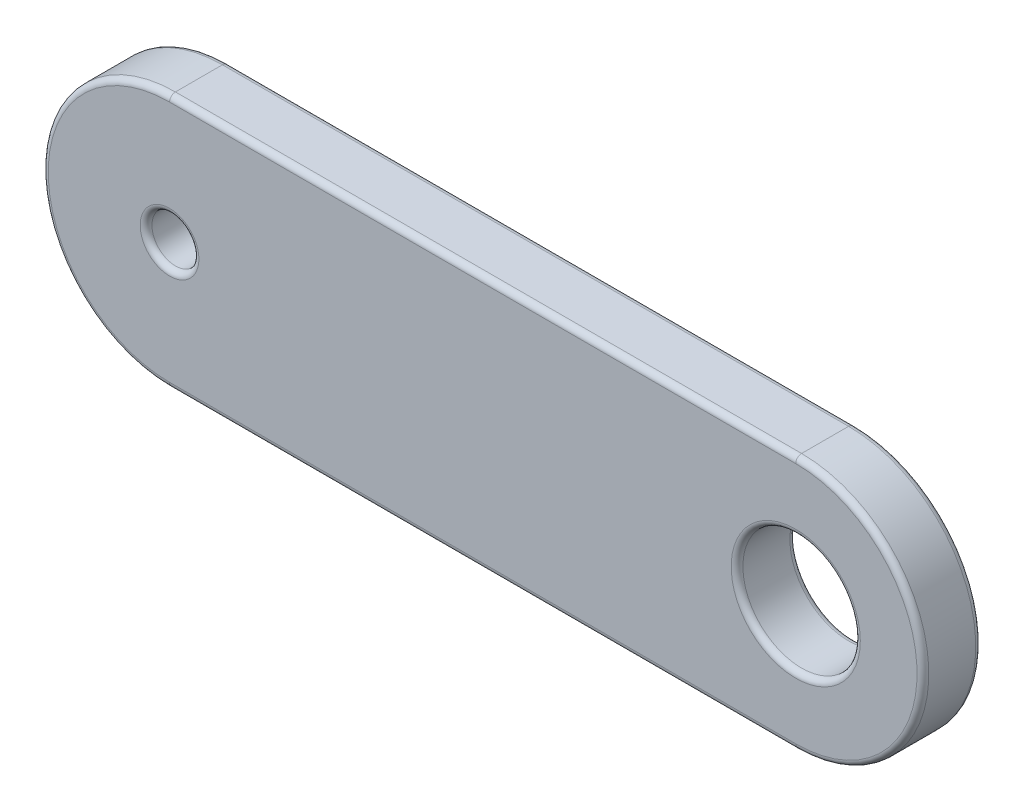
ISO-10303-21;
HEADER;
FILE_DESCRIPTION(('STEP AP214'),'2;1');
FILE_NAME('part.step','',(''),(''),'','','');
FILE_SCHEMA(('AUTOMOTIVE_DESIGN { 1 0 10303 214 1 1 1 1 }'));
ENDSEC;
DATA;
#1=APPLICATION_CONTEXT('core data for automotive mechanical design processes');
#2=APPLICATION_PROTOCOL_DEFINITION('international standard','automotive_design',2000,#1);
#3=PRODUCT_CONTEXT('',#1,'mechanical');
#4=PRODUCT('Part','Part','',(#3));
#5=PRODUCT_RELATED_PRODUCT_CATEGORY('part','',(#4));
#6=PRODUCT_DEFINITION_FORMATION('','',#4);
#7=PRODUCT_DEFINITION_CONTEXT('part definition',#1,'design');
#8=PRODUCT_DEFINITION('design','',#6,#7);
#9=PRODUCT_DEFINITION_SHAPE('','',#8);
#10=(LENGTH_UNIT() NAMED_UNIT(*) SI_UNIT(.MILLI.,.METRE.));
#11=(NAMED_UNIT(*) PLANE_ANGLE_UNIT() SI_UNIT($,.RADIAN.));
#12=(NAMED_UNIT(*) SI_UNIT($,.STERADIAN.) SOLID_ANGLE_UNIT());
#13=UNCERTAINTY_MEASURE_WITH_UNIT(LENGTH_MEASURE(1.E-05),#10,'distance_accuracy_value','');
#14=(GEOMETRIC_REPRESENTATION_CONTEXT(3) GLOBAL_UNCERTAINTY_ASSIGNED_CONTEXT((#13)) GLOBAL_UNIT_ASSIGNED_CONTEXT((#10,
#11,#12)) REPRESENTATION_CONTEXT('',''));
#15=CARTESIAN_POINT('',(0.,0.,0.));
#16=DIRECTION('',(0.,0.,1.));
#17=DIRECTION('',(1.,0.,0.));
#18=AXIS2_PLACEMENT_3D('',#15,#16,#17);
#19=CARTESIAN_POINT('',(-8.,0.,0.75));
#20=DIRECTION('',(0.,0.,1.));
#21=DIRECTION('',(1.,0.,0.));
#22=AXIS2_PLACEMENT_3D('',#19,#20,#21);
#23=PLANE('',#22);
#24=CARTESIAN_POINT('',(8.,0.,0.75));
#25=DIRECTION('',(0.,0.,1.));
#26=DIRECTION('',(1.,0.,0.));
#27=AXIS2_PLACEMENT_3D('',#24,#25,#26);
#28=CIRCLE('',#27,1.65);
#29=CARTESIAN_POINT('',(9.65,0.,0.75));
#30=VERTEX_POINT('',#29);
#31=EDGE_CURVE('E11',#30,#30,#28,.F.);
#32=ORIENTED_EDGE('',*,*,#31,.T.);
#33=EDGE_LOOP('',(#32));
#34=FACE_BOUND('',#33,.T.);
#35=CARTESIAN_POINT('',(8.,0.,0.75));
#36=DIRECTION('',(0.,0.,1.));
#37=DIRECTION('',(1.,0.,0.));
#38=AXIS2_PLACEMENT_3D('',#35,#36,#37);
#39=CIRCLE('',#38,3.1);
#40=CARTESIAN_POINT('',(8.,-3.1,0.75));
#41=VERTEX_POINT('',#40);
#42=CARTESIAN_POINT('',(8.,3.1,0.75));
#43=VERTEX_POINT('',#42);
#44=EDGE_CURVE('E50',#41,#43,#39,.T.);
#45=ORIENTED_EDGE('',*,*,#44,.T.);
#46=DIRECTION('',(-1.,0.,0.));
#47=VECTOR('',#46,1.);
#48=CARTESIAN_POINT('',(-8.,3.1,0.75));
#49=LINE('',#48,#47);
#50=CARTESIAN_POINT('',(-8.,3.1,0.75));
#51=VERTEX_POINT('',#50);
#52=EDGE_CURVE('E42',#43,#51,#49,.T.);
#53=ORIENTED_EDGE('',*,*,#52,.T.);
#54=CARTESIAN_POINT('',(-8.,0.,0.75));
#55=DIRECTION('',(0.,0.,1.));
#56=DIRECTION('',(1.,0.,0.));
#57=AXIS2_PLACEMENT_3D('',#54,#55,#56);
#58=CIRCLE('',#57,3.1);
#59=CARTESIAN_POINT('',(-8.,-3.1,0.75));
#60=VERTEX_POINT('',#59);
#61=EDGE_CURVE('E168',#51,#60,#58,.T.);
#62=ORIENTED_EDGE('',*,*,#61,.T.);
#63=DIRECTION('',(1.,0.,0.));
#64=VECTOR('',#63,1.);
#65=CARTESIAN_POINT('',(8.,-3.1,0.75));
#66=LINE('',#65,#64);
#67=EDGE_CURVE('E55',#60,#41,#66,.T.);
#68=ORIENTED_EDGE('',*,*,#67,.T.);
#69=EDGE_LOOP('',(#45,#53,#62,#68));
#70=FACE_BOUND('',#69,.T.);
#71=CARTESIAN_POINT('',(-8.,0.,0.75));
#72=DIRECTION('',(0.,0.,1.));
#73=DIRECTION('',(1.,0.,0.));
#74=AXIS2_PLACEMENT_3D('',#71,#72,#73);
#75=CIRCLE('',#74,0.75);
#76=CARTESIAN_POINT('',(-7.25,0.,0.75));
#77=VERTEX_POINT('',#76);
#78=EDGE_CURVE('E165',#77,#77,#75,.F.);
#79=ORIENTED_EDGE('',*,*,#78,.T.);
#80=EDGE_LOOP('',(#79));
#81=FACE_BOUND('',#80,.T.);
#82=ADVANCED_FACE('F33',(#34,#70,#81),#23,.T.);
#83=CARTESIAN_POINT('',(-8.,0.,-0.75));
#84=DIRECTION('',(0.,0.,1.));
#85=DIRECTION('',(1.,0.,0.));
#86=AXIS2_PLACEMENT_3D('',#83,#84,#85);
#87=PLANE('',#86);
#88=CARTESIAN_POINT('',(8.,0.,-0.75));
#89=DIRECTION('',(0.,0.,1.));
#90=DIRECTION('',(1.,0.,0.));
#91=AXIS2_PLACEMENT_3D('',#88,#89,#90);
#92=CIRCLE('',#91,1.65);
#93=CARTESIAN_POINT('',(9.65,0.,-0.75));
#94=VERTEX_POINT('',#93);
#95=EDGE_CURVE('E130',#94,#94,#92,.T.);
#96=ORIENTED_EDGE('',*,*,#95,.T.);
#97=EDGE_LOOP('',(#96));
#98=FACE_BOUND('',#97,.T.);
#99=CARTESIAN_POINT('',(-8.,0.,-0.75));
#100=DIRECTION('',(0.,0.,1.));
#101=DIRECTION('',(1.,0.,0.));
#102=AXIS2_PLACEMENT_3D('',#99,#100,#101);
#103=CIRCLE('',#102,0.75);
#104=CARTESIAN_POINT('',(-7.25,0.,-0.75));
#105=VERTEX_POINT('',#104);
#106=EDGE_CURVE('E127',#105,#105,#103,.T.);
#107=ORIENTED_EDGE('',*,*,#106,.T.);
#108=EDGE_LOOP('',(#107));
#109=FACE_BOUND('',#108,.T.);
#110=CARTESIAN_POINT('',(8.,0.,-0.75));
#111=DIRECTION('',(0.,0.,1.));
#112=DIRECTION('',(1.,0.,0.));
#113=AXIS2_PLACEMENT_3D('',#110,#111,#112);
#114=CIRCLE('',#113,3.1);
#115=CARTESIAN_POINT('',(8.,3.1,-0.75));
#116=VERTEX_POINT('',#115);
#117=CARTESIAN_POINT('',(8.,-3.1,-0.75));
#118=VERTEX_POINT('',#117);
#119=EDGE_CURVE('E126',#116,#118,#114,.F.);
#120=ORIENTED_EDGE('',*,*,#119,.T.);
#121=DIRECTION('',(1.,0.,0.));
#122=VECTOR('',#121,1.);
#123=CARTESIAN_POINT('',(-8.,-3.1,-0.75));
#124=LINE('',#123,#122);
#125=CARTESIAN_POINT('',(-8.,-3.1,-0.75));
#126=VERTEX_POINT('',#125);
#127=EDGE_CURVE('E105',#118,#126,#124,.F.);
#128=ORIENTED_EDGE('',*,*,#127,.T.);
#129=CARTESIAN_POINT('',(-8.,0.,-0.75));
#130=DIRECTION('',(0.,0.,1.));
#131=DIRECTION('',(1.,0.,0.));
#132=AXIS2_PLACEMENT_3D('',#129,#130,#131);
#133=CIRCLE('',#132,3.1);
#134=CARTESIAN_POINT('',(-8.,3.1,-0.75));
#135=VERTEX_POINT('',#134);
#136=EDGE_CURVE('E115',#126,#135,#133,.F.);
#137=ORIENTED_EDGE('',*,*,#136,.T.);
#138=DIRECTION('',(-1.,0.,0.));
#139=VECTOR('',#138,1.);
#140=CARTESIAN_POINT('',(-8.,3.1,-0.75));
#141=LINE('',#140,#139);
#142=EDGE_CURVE('E121',#135,#116,#141,.F.);
#143=ORIENTED_EDGE('',*,*,#142,.T.);
#144=EDGE_LOOP('',(#120,#128,#137,#143));
#145=FACE_BOUND('',#144,.T.);
#146=ADVANCED_FACE('F124',(#98,#109,#145),#87,.F.);
#147=CARTESIAN_POINT('',(-8.,0.,0.75));
#148=DIRECTION('',(0.,0.,-1.));
#149=DIRECTION('',(-1.,0.,0.));
#150=AXIS2_PLACEMENT_3D('',#147,#148,#149);
#151=CYLINDRICAL_SURFACE('',#150,3.25);
#152=DIRECTION('',(0.,0.,-1.));
#153=VECTOR('',#152,1.);
#154=CARTESIAN_POINT('',(-8.,3.25,0.75));
#155=LINE('',#154,#153);
#156=CARTESIAN_POINT('',(-8.,3.25,0.6));
#157=VERTEX_POINT('',#156);
#158=CARTESIAN_POINT('',(-8.,3.25,-0.6));
#159=VERTEX_POINT('',#158);
#160=EDGE_CURVE('E177',#157,#159,#155,.T.);
#161=ORIENTED_EDGE('',*,*,#160,.T.);
#162=CARTESIAN_POINT('',(-8.,0.,-0.6));
#163=DIRECTION('',(0.,0.,1.));
#164=DIRECTION('',(1.,0.,0.));
#165=AXIS2_PLACEMENT_3D('',#162,#163,#164);
#166=CIRCLE('',#165,3.25);
#167=CARTESIAN_POINT('',(-8.,-3.25,-0.6));
#168=VERTEX_POINT('',#167);
#169=EDGE_CURVE('E163',#159,#168,#166,.T.);
#170=ORIENTED_EDGE('',*,*,#169,.T.);
#171=DIRECTION('',(0.,0.,-1.));
#172=VECTOR('',#171,1.);
#173=CARTESIAN_POINT('',(-8.,-3.25,0.75));
#174=LINE('',#173,#172);
#175=CARTESIAN_POINT('',(-8.,-3.25,0.6));
#176=VERTEX_POINT('',#175);
#177=EDGE_CURVE('E122',#176,#168,#174,.T.);
#178=ORIENTED_EDGE('',*,*,#177,.F.);
#179=CARTESIAN_POINT('',(-8.,0.,0.6));
#180=DIRECTION('',(0.,0.,1.));
#181=DIRECTION('',(1.,0.,0.));
#182=AXIS2_PLACEMENT_3D('',#179,#180,#181);
#183=CIRCLE('',#182,3.25);
#184=EDGE_CURVE('E161',#176,#157,#183,.F.);
#185=ORIENTED_EDGE('',*,*,#184,.T.);
#186=EDGE_LOOP('',(#161,#170,#178,#185));
#187=FACE_BOUND('',#186,.T.);
#188=ADVANCED_FACE('F203',(#187),#151,.T.);
#189=CARTESIAN_POINT('',(-8.,-3.25,0.75));
#190=DIRECTION('',(0.,1.,0.));
#191=DIRECTION('',(0.,0.,1.));
#192=AXIS2_PLACEMENT_3D('',#189,#190,#191);
#193=PLANE('',#192);
#194=ORIENTED_EDGE('',*,*,#177,.T.);
#195=DIRECTION('',(1.,0.,0.));
#196=VECTOR('',#195,1.);
#197=CARTESIAN_POINT('',(-8.,-3.25,-0.6));
#198=LINE('',#197,#196);
#199=CARTESIAN_POINT('',(8.,-3.25,-0.6));
#200=VERTEX_POINT('',#199);
#201=EDGE_CURVE('E108',#168,#200,#198,.T.);
#202=ORIENTED_EDGE('',*,*,#201,.T.);
#203=DIRECTION('',(0.,0.,-1.));
#204=VECTOR('',#203,1.);
#205=CARTESIAN_POINT('',(8.,-3.25,0.75));
#206=LINE('',#205,#204);
#207=CARTESIAN_POINT('',(8.,-3.25,0.6));
#208=VERTEX_POINT('',#207);
#209=EDGE_CURVE('E200',#208,#200,#206,.T.);
#210=ORIENTED_EDGE('',*,*,#209,.F.);
#211=DIRECTION('',(1.,0.,0.));
#212=VECTOR('',#211,1.);
#213=CARTESIAN_POINT('',(-8.,-3.25,0.6));
#214=LINE('',#213,#212);
#215=EDGE_CURVE('E149',#208,#176,#214,.F.);
#216=ORIENTED_EDGE('',*,*,#215,.T.);
#217=EDGE_LOOP('',(#194,#202,#210,#216));
#218=FACE_BOUND('',#217,.T.);
#219=ADVANCED_FACE('F198',(#218),#193,.F.);
#220=CARTESIAN_POINT('',(8.,0.,0.75));
#221=DIRECTION('',(0.,0.,-1.));
#222=DIRECTION('',(-1.,0.,0.));
#223=AXIS2_PLACEMENT_3D('',#220,#221,#222);
#224=CYLINDRICAL_SURFACE('',#223,3.25);
#225=ORIENTED_EDGE('',*,*,#209,.T.);
#226=CARTESIAN_POINT('',(8.,0.,-0.6));
#227=DIRECTION('',(0.,0.,1.));
#228=DIRECTION('',(1.,0.,0.));
#229=AXIS2_PLACEMENT_3D('',#226,#227,#228);
#230=CIRCLE('',#229,3.25);
#231=CARTESIAN_POINT('',(8.,3.25,-0.6));
#232=VERTEX_POINT('',#231);
#233=EDGE_CURVE('E154',#200,#232,#230,.T.);
#234=ORIENTED_EDGE('',*,*,#233,.T.);
#235=DIRECTION('',(0.,0.,-1.));
#236=VECTOR('',#235,1.);
#237=CARTESIAN_POINT('',(8.,3.25,0.75));
#238=LINE('',#237,#236);
#239=CARTESIAN_POINT('',(8.,3.25,0.6));
#240=VERTEX_POINT('',#239);
#241=EDGE_CURVE('E206',#240,#232,#238,.T.);
#242=ORIENTED_EDGE('',*,*,#241,.F.);
#243=CARTESIAN_POINT('',(8.,0.,0.6));
#244=DIRECTION('',(0.,0.,1.));
#245=DIRECTION('',(1.,0.,0.));
#246=AXIS2_PLACEMENT_3D('',#243,#244,#245);
#247=CIRCLE('',#246,3.25);
#248=EDGE_CURVE('E152',#240,#208,#247,.F.);
#249=ORIENTED_EDGE('',*,*,#248,.T.);
#250=EDGE_LOOP('',(#225,#234,#242,#249));
#251=FACE_BOUND('',#250,.T.);
#252=ADVANCED_FACE('F219',(#251),#224,.T.);
#253=CARTESIAN_POINT('',(-8.,3.25,0.75));
#254=DIRECTION('',(0.,-1.,0.));
#255=DIRECTION('',(1.,0.,0.));
#256=AXIS2_PLACEMENT_3D('',#253,#254,#255);
#257=PLANE('',#256);
#258=ORIENTED_EDGE('',*,*,#241,.T.);
#259=DIRECTION('',(-1.,0.,0.));
#260=VECTOR('',#259,1.);
#261=CARTESIAN_POINT('',(-8.,3.25,-0.6));
#262=LINE('',#261,#260);
#263=EDGE_CURVE('E159',#232,#159,#262,.T.);
#264=ORIENTED_EDGE('',*,*,#263,.T.);
#265=ORIENTED_EDGE('',*,*,#160,.F.);
#266=DIRECTION('',(-1.,0.,0.));
#267=VECTOR('',#266,1.);
#268=CARTESIAN_POINT('',(8.,3.25,0.6));
#269=LINE('',#268,#267);
#270=EDGE_CURVE('E156',#157,#240,#269,.F.);
#271=ORIENTED_EDGE('',*,*,#270,.T.);
#272=EDGE_LOOP('',(#258,#264,#265,#271));
#273=FACE_BOUND('',#272,.T.);
#274=ADVANCED_FACE('F223',(#273),#257,.F.);
#275=CARTESIAN_POINT('',(-8.,0.,0.75));
#276=DIRECTION('',(0.,0.,-1.));
#277=DIRECTION('',(-1.,0.,0.));
#278=AXIS2_PLACEMENT_3D('',#275,#276,#277);
#279=CYLINDRICAL_SURFACE('',#278,0.6);
#280=CARTESIAN_POINT('',(-8.,0.,-0.6));
#281=DIRECTION('',(0.,0.,1.));
#282=DIRECTION('',(1.,0.,0.));
#283=AXIS2_PLACEMENT_3D('',#280,#281,#282);
#284=CIRCLE('',#283,0.6);
#285=CARTESIAN_POINT('',(-7.4,0.,-0.6));
#286=VERTEX_POINT('',#285);
#287=EDGE_CURVE('E146',#286,#286,#284,.F.);
#288=ORIENTED_EDGE('',*,*,#287,.T.);
#289=EDGE_LOOP('',(#288));
#290=FACE_BOUND('',#289,.T.);
#291=CARTESIAN_POINT('',(-8.,0.,0.6));
#292=DIRECTION('',(0.,0.,1.));
#293=DIRECTION('',(1.,0.,0.));
#294=AXIS2_PLACEMENT_3D('',#291,#292,#293);
#295=CIRCLE('',#294,0.6);
#296=CARTESIAN_POINT('',(-7.4,0.,0.6));
#297=VERTEX_POINT('',#296);
#298=EDGE_CURVE('E143',#297,#297,#295,.T.);
#299=ORIENTED_EDGE('',*,*,#298,.T.);
#300=EDGE_LOOP('',(#299));
#301=FACE_BOUND('',#300,.T.);
#302=ADVANCED_FACE('F239',(#290,#301),#279,.F.);
#303=CARTESIAN_POINT('',(8.,0.,0.75));
#304=DIRECTION('',(0.,0.,-1.));
#305=DIRECTION('',(-1.,0.,0.));
#306=AXIS2_PLACEMENT_3D('',#303,#304,#305);
#307=CYLINDRICAL_SURFACE('',#306,1.5);
#308=CARTESIAN_POINT('',(8.,0.,-0.6));
#309=DIRECTION('',(0.,0.,1.));
#310=DIRECTION('',(1.,0.,0.));
#311=AXIS2_PLACEMENT_3D('',#308,#309,#310);
#312=CIRCLE('',#311,1.5);
#313=CARTESIAN_POINT('',(9.5,0.,-0.6));
#314=VERTEX_POINT('',#313);
#315=EDGE_CURVE('E140',#314,#314,#312,.F.);
#316=ORIENTED_EDGE('',*,*,#315,.T.);
#317=EDGE_LOOP('',(#316));
#318=FACE_BOUND('',#317,.T.);
#319=CARTESIAN_POINT('',(8.,0.,0.6));
#320=DIRECTION('',(0.,0.,1.));
#321=DIRECTION('',(1.,0.,0.));
#322=AXIS2_PLACEMENT_3D('',#319,#320,#321);
#323=CIRCLE('',#322,1.5);
#324=CARTESIAN_POINT('',(9.5,0.,0.6));
#325=VERTEX_POINT('',#324);
#326=EDGE_CURVE('E137',#325,#325,#323,.T.);
#327=ORIENTED_EDGE('',*,*,#326,.T.);
#328=EDGE_LOOP('',(#327));
#329=FACE_BOUND('',#328,.T.);
#330=ADVANCED_FACE('F241',(#318,#329),#307,.F.);
#331=CARTESIAN_POINT('',(8.,0.,-0.6));
#332=DIRECTION('',(0.,0.,1.));
#333=DIRECTION('',(1.,0.,0.));
#334=AXIS2_PLACEMENT_3D('',#331,#332,#333);
#335=TOROIDAL_SURFACE('',#334,1.65,0.15);
#336=ORIENTED_EDGE('',*,*,#315,.F.);
#337=EDGE_LOOP('',(#336));
#338=FACE_BOUND('',#337,.T.);
#339=ORIENTED_EDGE('',*,*,#95,.F.);
#340=EDGE_LOOP('',(#339));
#341=FACE_BOUND('',#340,.T.);
#342=ADVANCED_FACE('F248',(#338,#341),#335,.T.);
#343=CARTESIAN_POINT('',(-8.,0.,-0.6));
#344=DIRECTION('',(0.,0.,1.));
#345=DIRECTION('',(1.,0.,0.));
#346=AXIS2_PLACEMENT_3D('',#343,#344,#345);
#347=TOROIDAL_SURFACE('',#346,0.75,0.15);
#348=ORIENTED_EDGE('',*,*,#287,.F.);
#349=EDGE_LOOP('',(#348));
#350=FACE_BOUND('',#349,.T.);
#351=ORIENTED_EDGE('',*,*,#106,.F.);
#352=EDGE_LOOP('',(#351));
#353=FACE_BOUND('',#352,.T.);
#354=ADVANCED_FACE('F264',(#350,#353),#347,.T.);
#355=CARTESIAN_POINT('',(-8.,3.1,-0.6));
#356=DIRECTION('',(-1.,0.,0.));
#357=DIRECTION('',(0.,-1.,0.));
#358=AXIS2_PLACEMENT_3D('',#355,#356,#357);
#359=CYLINDRICAL_SURFACE('',#358,0.15);
#360=CARTESIAN_POINT('',(8.,3.1,-0.6));
#361=DIRECTION('',(1.,0.,0.));
#362=DIRECTION('',(0.,0.,-1.));
#363=AXIS2_PLACEMENT_3D('',#360,#361,#362);
#364=CIRCLE('',#363,0.15);
#365=EDGE_CURVE('E111',#116,#232,#364,.T.);
#366=ORIENTED_EDGE('',*,*,#365,.F.);
#367=ORIENTED_EDGE('',*,*,#142,.F.);
#368=CARTESIAN_POINT('',(-8.,3.1,-0.6));
#369=DIRECTION('',(-1.,0.,0.));
#370=DIRECTION('',(0.,0.,1.));
#371=AXIS2_PLACEMENT_3D('',#368,#369,#370);
#372=CIRCLE('',#371,0.15);
#373=EDGE_CURVE('E118',#159,#135,#372,.T.);
#374=ORIENTED_EDGE('',*,*,#373,.F.);
#375=ORIENTED_EDGE('',*,*,#263,.F.);
#376=EDGE_LOOP('',(#366,#367,#374,#375));
#377=FACE_BOUND('',#376,.T.);
#378=ADVANCED_FACE('F212',(#377),#359,.T.);
#379=CARTESIAN_POINT('',(-8.,0.,-0.6));
#380=DIRECTION('',(0.,0.,1.));
#381=DIRECTION('',(1.,0.,0.));
#382=AXIS2_PLACEMENT_3D('',#379,#380,#381);
#383=TOROIDAL_SURFACE('',#382,3.1,0.15);
#384=ORIENTED_EDGE('',*,*,#373,.T.);
#385=ORIENTED_EDGE('',*,*,#136,.F.);
#386=CARTESIAN_POINT('',(-8.,-3.1,-0.6));
#387=DIRECTION('',(1.,0.,0.));
#388=DIRECTION('',(0.,0.,-1.));
#389=AXIS2_PLACEMENT_3D('',#386,#387,#388);
#390=CIRCLE('',#389,0.15);
#391=EDGE_CURVE('E101',#168,#126,#390,.T.);
#392=ORIENTED_EDGE('',*,*,#391,.F.);
#393=ORIENTED_EDGE('',*,*,#169,.F.);
#394=EDGE_LOOP('',(#384,#385,#392,#393));
#395=FACE_BOUND('',#394,.T.);
#396=ADVANCED_FACE('F116',(#395),#383,.T.);
#397=CARTESIAN_POINT('',(8.,0.,-0.6));
#398=DIRECTION('',(0.,0.,1.));
#399=DIRECTION('',(1.,0.,0.));
#400=AXIS2_PLACEMENT_3D('',#397,#398,#399);
#401=TOROIDAL_SURFACE('',#400,3.1,0.15);
#402=ORIENTED_EDGE('',*,*,#365,.T.);
#403=ORIENTED_EDGE('',*,*,#233,.F.);
#404=CARTESIAN_POINT('',(8.,-3.1,-0.6));
#405=DIRECTION('',(-1.,0.,0.));
#406=DIRECTION('',(0.,0.,1.));
#407=AXIS2_PLACEMENT_3D('',#404,#405,#406);
#408=CIRCLE('',#407,0.15);
#409=EDGE_CURVE('E112',#118,#200,#408,.T.);
#410=ORIENTED_EDGE('',*,*,#409,.F.);
#411=ORIENTED_EDGE('',*,*,#119,.F.);
#412=EDGE_LOOP('',(#402,#403,#410,#411));
#413=FACE_BOUND('',#412,.T.);
#414=ADVANCED_FACE('F215',(#413),#401,.T.);
#415=CARTESIAN_POINT('',(-8.,-3.1,-0.6));
#416=DIRECTION('',(1.,0.,0.));
#417=DIRECTION('',(0.,0.,-1.));
#418=AXIS2_PLACEMENT_3D('',#415,#416,#417);
#419=CYLINDRICAL_SURFACE('',#418,0.15);
#420=ORIENTED_EDGE('',*,*,#391,.T.);
#421=ORIENTED_EDGE('',*,*,#127,.F.);
#422=ORIENTED_EDGE('',*,*,#409,.T.);
#423=ORIENTED_EDGE('',*,*,#201,.F.);
#424=EDGE_LOOP('',(#420,#421,#422,#423));
#425=FACE_BOUND('',#424,.T.);
#426=ADVANCED_FACE('F103',(#425),#419,.T.);
#427=CARTESIAN_POINT('',(8.,0.,0.6));
#428=DIRECTION('',(0.,0.,1.));
#429=DIRECTION('',(1.,0.,0.));
#430=AXIS2_PLACEMENT_3D('',#427,#428,#429);
#431=TOROIDAL_SURFACE('',#430,1.65,0.15);
#432=ORIENTED_EDGE('',*,*,#31,.F.);
#433=EDGE_LOOP('',(#432));
#434=FACE_BOUND('',#433,.T.);
#435=ORIENTED_EDGE('',*,*,#326,.F.);
#436=EDGE_LOOP('',(#435));
#437=FACE_BOUND('',#436,.T.);
#438=ADVANCED_FACE('F271',(#434,#437),#431,.T.);
#439=CARTESIAN_POINT('',(-8.,-3.1,0.6));
#440=DIRECTION('',(-1.,0.,0.));
#441=DIRECTION('',(0.,0.,1.));
#442=AXIS2_PLACEMENT_3D('',#439,#440,#441);
#443=CYLINDRICAL_SURFACE('',#442,0.15);
#444=CARTESIAN_POINT('',(-8.,-3.1,0.6));
#445=DIRECTION('',(-1.,0.,0.));
#446=DIRECTION('',(0.,0.,1.));
#447=AXIS2_PLACEMENT_3D('',#444,#445,#446);
#448=CIRCLE('',#447,0.15);
#449=EDGE_CURVE('E181',#176,#60,#448,.T.);
#450=ORIENTED_EDGE('',*,*,#449,.F.);
#451=ORIENTED_EDGE('',*,*,#215,.F.);
#452=CARTESIAN_POINT('',(8.,-3.1,0.6));
#453=DIRECTION('',(1.,0.,0.));
#454=DIRECTION('',(0.,0.,-1.));
#455=AXIS2_PLACEMENT_3D('',#452,#453,#454);
#456=CIRCLE('',#455,0.15);
#457=EDGE_CURVE('E37',#41,#208,#456,.T.);
#458=ORIENTED_EDGE('',*,*,#457,.F.);
#459=ORIENTED_EDGE('',*,*,#67,.F.);
#460=EDGE_LOOP('',(#450,#451,#458,#459));
#461=FACE_BOUND('',#460,.T.);
#462=ADVANCED_FACE('F193',(#461),#443,.T.);
#463=CARTESIAN_POINT('',(8.,0.,0.6));
#464=DIRECTION('',(0.,0.,1.));
#465=DIRECTION('',(1.,0.,0.));
#466=AXIS2_PLACEMENT_3D('',#463,#464,#465);
#467=TOROIDAL_SURFACE('',#466,3.1,0.15);
#468=ORIENTED_EDGE('',*,*,#457,.T.);
#469=ORIENTED_EDGE('',*,*,#248,.F.);
#470=CARTESIAN_POINT('',(8.,3.1,0.6));
#471=DIRECTION('',(-1.,0.,0.));
#472=DIRECTION('',(0.,0.,1.));
#473=AXIS2_PLACEMENT_3D('',#470,#471,#472);
#474=CIRCLE('',#473,0.15);
#475=EDGE_CURVE('E180',#43,#240,#474,.T.);
#476=ORIENTED_EDGE('',*,*,#475,.F.);
#477=ORIENTED_EDGE('',*,*,#44,.F.);
#478=EDGE_LOOP('',(#468,#469,#476,#477));
#479=FACE_BOUND('',#478,.T.);
#480=ADVANCED_FACE('F190',(#479),#467,.T.);
#481=CARTESIAN_POINT('',(-8.,0.,0.6));
#482=DIRECTION('',(0.,0.,1.));
#483=DIRECTION('',(1.,0.,0.));
#484=AXIS2_PLACEMENT_3D('',#481,#482,#483);
#485=TOROIDAL_SURFACE('',#484,3.1,0.15);
#486=ORIENTED_EDGE('',*,*,#449,.T.);
#487=ORIENTED_EDGE('',*,*,#61,.F.);
#488=CARTESIAN_POINT('',(-8.,3.1,0.6));
#489=DIRECTION('',(1.,0.,0.));
#490=DIRECTION('',(0.,0.,-1.));
#491=AXIS2_PLACEMENT_3D('',#488,#489,#490);
#492=CIRCLE('',#491,0.15);
#493=EDGE_CURVE('E178',#157,#51,#492,.T.);
#494=ORIENTED_EDGE('',*,*,#493,.F.);
#495=ORIENTED_EDGE('',*,*,#184,.F.);
#496=EDGE_LOOP('',(#486,#487,#494,#495));
#497=FACE_BOUND('',#496,.T.);
#498=ADVANCED_FACE('F228',(#497),#485,.T.);
#499=CARTESIAN_POINT('',(-8.,3.1,0.6));
#500=DIRECTION('',(1.,0.,0.));
#501=DIRECTION('',(0.,1.,0.));
#502=AXIS2_PLACEMENT_3D('',#499,#500,#501);
#503=CYLINDRICAL_SURFACE('',#502,0.15);
#504=ORIENTED_EDGE('',*,*,#475,.T.);
#505=ORIENTED_EDGE('',*,*,#270,.F.);
#506=ORIENTED_EDGE('',*,*,#493,.T.);
#507=ORIENTED_EDGE('',*,*,#52,.F.);
#508=EDGE_LOOP('',(#504,#505,#506,#507));
#509=FACE_BOUND('',#508,.T.);
#510=ADVANCED_FACE('F226',(#509),#503,.T.);
#511=CARTESIAN_POINT('',(-8.,0.,0.6));
#512=DIRECTION('',(0.,0.,1.));
#513=DIRECTION('',(1.,0.,0.));
#514=AXIS2_PLACEMENT_3D('',#511,#512,#513);
#515=TOROIDAL_SURFACE('',#514,0.75,0.15);
#516=ORIENTED_EDGE('',*,*,#78,.F.);
#517=EDGE_LOOP('',(#516));
#518=FACE_BOUND('',#517,.T.);
#519=ORIENTED_EDGE('',*,*,#298,.F.);
#520=EDGE_LOOP('',(#519));
#521=FACE_BOUND('',#520,.T.);
#522=ADVANCED_FACE('F35',(#518,#521),#515,.T.);
#523=CLOSED_SHELL('',(#82,#146,#188,#219,#252,#274,#302,#330,#342,#354,#378,#396,#414,#426,#438,
#462,#480,#498,#510,#522));
#524=MANIFOLD_SOLID_BREP('B2',#523);
#525=ADVANCED_BREP_SHAPE_REPRESENTATION('',(#18,#524),#14);
#526=SHAPE_DEFINITION_REPRESENTATION(#9,#525);
ENDSEC;
END-ISO-10303-21;
